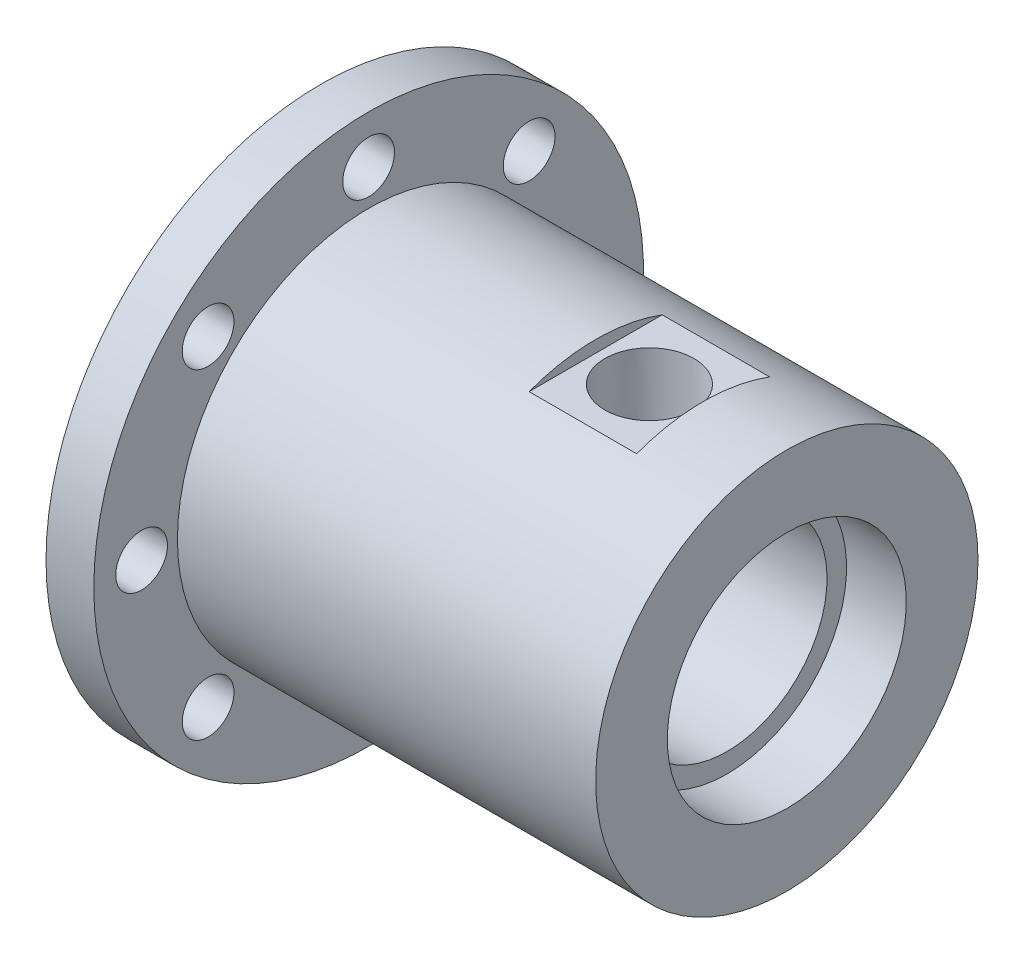
ISO-10303-21;
HEADER;
FILE_DESCRIPTION(('STEP AP214'),'2;1');
FILE_NAME('part.step','',(''),(''),'','','');
FILE_SCHEMA(('AUTOMOTIVE_DESIGN { 1 0 10303 214 1 1 1 1 }'));
ENDSEC;
DATA;
#1=APPLICATION_CONTEXT('core data for automotive mechanical design processes');
#2=APPLICATION_PROTOCOL_DEFINITION('international standard','automotive_design',2000,#1);
#3=PRODUCT_CONTEXT('',#1,'mechanical');
#4=PRODUCT('Part','Part','',(#3));
#5=PRODUCT_RELATED_PRODUCT_CATEGORY('part','',(#4));
#6=PRODUCT_DEFINITION_FORMATION('','',#4);
#7=PRODUCT_DEFINITION_CONTEXT('part definition',#1,'design');
#8=PRODUCT_DEFINITION('design','',#6,#7);
#9=PRODUCT_DEFINITION_SHAPE('','',#8);
#10=(LENGTH_UNIT() NAMED_UNIT(*) SI_UNIT(.MILLI.,.METRE.));
#11=(NAMED_UNIT(*) PLANE_ANGLE_UNIT() SI_UNIT($,.RADIAN.));
#12=(NAMED_UNIT(*) SI_UNIT($,.STERADIAN.) SOLID_ANGLE_UNIT());
#13=UNCERTAINTY_MEASURE_WITH_UNIT(LENGTH_MEASURE(1.E-05),#10,'distance_accuracy_value','');
#14=(GEOMETRIC_REPRESENTATION_CONTEXT(3) GLOBAL_UNCERTAINTY_ASSIGNED_CONTEXT((#13)) GLOBAL_UNIT_ASSIGNED_CONTEXT((#10,
#11,#12)) REPRESENTATION_CONTEXT('',''));
#15=CARTESIAN_POINT('',(0.,0.,0.));
#16=DIRECTION('',(0.,0.,1.));
#17=DIRECTION('',(1.,0.,0.));
#18=AXIS2_PLACEMENT_3D('',#15,#16,#17);
#19=CARTESIAN_POINT('',(-49.53,0.,0.));
#20=DIRECTION('',(1.,0.,0.));
#21=DIRECTION('',(0.,0.,-1.));
#22=AXIS2_PLACEMENT_3D('',#19,#20,#21);
#23=PLANE('',#22);
#24=CARTESIAN_POINT('',(-49.53,0.,0.));
#25=DIRECTION('',(1.,0.,0.));
#26=DIRECTION('',(0.,1.,0.));
#27=AXIS2_PLACEMENT_3D('',#24,#25,#26);
#28=CIRCLE('',#27,12.7);
#29=CARTESIAN_POINT('',(-49.53,12.7,0.));
#30=VERTEX_POINT('',#29);
#31=EDGE_CURVE('E171',#30,#30,#28,.T.);
#32=ORIENTED_EDGE('',*,*,#31,.T.);
#33=EDGE_LOOP('',(#32));
#34=FACE_BOUND('',#33,.T.);
#35=CARTESIAN_POINT('',(-49.53,0.,0.));
#36=DIRECTION('',(-1.,0.,0.));
#37=DIRECTION('',(0.,0.,1.));
#38=AXIS2_PLACEMENT_3D('',#35,#36,#37);
#39=CIRCLE('',#38,14.1478);
#40=CARTESIAN_POINT('',(-49.53,0.,14.1478));
#41=VERTEX_POINT('',#40);
#42=EDGE_CURVE('E512',#41,#41,#39,.T.);
#43=ORIENTED_EDGE('',*,*,#42,.T.);
#44=EDGE_LOOP('',(#43));
#45=FACE_BOUND('',#44,.T.);
#46=ADVANCED_FACE('F46',(#34,#45),#23,.F.);
#47=CARTESIAN_POINT('',(-44.45,0.,0.));
#48=DIRECTION('',(-1.,0.,0.));
#49=DIRECTION('',(0.,0.,1.));
#50=AXIS2_PLACEMENT_3D('',#47,#48,#49);
#51=PLANE('',#50);
#52=CARTESIAN_POINT('',(-44.45,24.13,0.));
#53=DIRECTION('',(1.,0.,0.));
#54=DIRECTION('',(0.,0.,-1.));
#55=AXIS2_PLACEMENT_3D('',#52,#53,#54);
#56=CIRCLE('',#55,2.74999999999999);
#57=CARTESIAN_POINT('',(-44.45,24.13,-2.74999999999999));
#58=VERTEX_POINT('',#57);
#59=EDGE_CURVE('E84',#58,#58,#56,.T.);
#60=ORIENTED_EDGE('',*,*,#59,.F.);
#61=EDGE_LOOP('',(#60));
#62=FACE_BOUND('',#61,.T.);
#63=CARTESIAN_POINT('',(-44.45,-24.13,-3.42021402459922E-12));
#64=DIRECTION('',(1.,0.,0.));
#65=DIRECTION('',(0.,0.,-1.));
#66=AXIS2_PLACEMENT_3D('',#63,#64,#65);
#67=CIRCLE('',#66,2.74999999999999);
#68=CARTESIAN_POINT('',(-44.45,-24.13,-2.75000000000341));
#69=VERTEX_POINT('',#68);
#70=EDGE_CURVE('E119',#69,#69,#67,.T.);
#71=ORIENTED_EDGE('',*,*,#70,.F.);
#72=EDGE_LOOP('',(#71));
#73=FACE_BOUND('',#72,.T.);
#74=CARTESIAN_POINT('',(-44.45,0.,0.));
#75=DIRECTION('',(-1.,0.,0.));
#76=DIRECTION('',(0.,0.,1.));
#77=AXIS2_PLACEMENT_3D('',#74,#75,#76);
#78=CIRCLE('',#77,20.32);
#79=CARTESIAN_POINT('',(-44.45,0.,20.32));
#80=VERTEX_POINT('',#79);
#81=EDGE_CURVE('E147',#80,#80,#78,.F.);
#82=ORIENTED_EDGE('',*,*,#81,.F.);
#83=EDGE_LOOP('',(#82));
#84=FACE_BOUND('',#83,.T.);
#85=CARTESIAN_POINT('',(-44.45,0.,0.));
#86=DIRECTION('',(-1.,0.,0.));
#87=DIRECTION('',(0.,0.,1.));
#88=AXIS2_PLACEMENT_3D('',#85,#86,#87);
#89=CIRCLE('',#88,29.21);
#90=CARTESIAN_POINT('',(-44.45,0.,29.21));
#91=VERTEX_POINT('',#90);
#92=EDGE_CURVE('E144',#91,#91,#89,.T.);
#93=ORIENTED_EDGE('',*,*,#92,.F.);
#94=EDGE_LOOP('',(#93));
#95=FACE_BOUND('',#94,.T.);
#96=CARTESIAN_POINT('',(-44.45,17.0624866300302,17.0624866300309));
#97=DIRECTION('',(1.,0.,0.));
#98=DIRECTION('',(0.,0.,-1.));
#99=AXIS2_PLACEMENT_3D('',#96,#97,#98);
#100=CIRCLE('',#99,2.74999999999999);
#101=CARTESIAN_POINT('',(-44.45,17.0624866300302,14.3124866300309));
#102=VERTEX_POINT('',#101);
#103=EDGE_CURVE('E137',#102,#102,#100,.T.);
#104=ORIENTED_EDGE('',*,*,#103,.F.);
#105=EDGE_LOOP('',(#104));
#106=FACE_BOUND('',#105,.T.);
#107=CARTESIAN_POINT('',(-44.45,-1.71306208502595E-12,24.1299999999983));
#108=DIRECTION('',(1.,0.,0.));
#109=DIRECTION('',(0.,0.,-1.));
#110=AXIS2_PLACEMENT_3D('',#107,#108,#109);
#111=CIRCLE('',#110,2.74999999999999);
#112=CARTESIAN_POINT('',(-44.45,-1.71306208502595E-12,21.3799999999983));
#113=VERTEX_POINT('',#112);
#114=EDGE_CURVE('E131',#113,#113,#111,.T.);
#115=ORIENTED_EDGE('',*,*,#114,.F.);
#116=EDGE_LOOP('',(#115));
#117=FACE_BOUND('',#116,.T.);
#118=CARTESIAN_POINT('',(-44.45,-17.0624866300326,17.0624866300285));
#119=DIRECTION('',(1.,0.,0.));
#120=DIRECTION('',(0.,0.,-1.));
#121=AXIS2_PLACEMENT_3D('',#118,#119,#120);
#122=CIRCLE('',#121,2.74999999999999);
#123=CARTESIAN_POINT('',(-44.45,-17.0624866300326,14.3124866300285));
#124=VERTEX_POINT('',#123);
#125=EDGE_CURVE('E125',#124,#124,#122,.T.);
#126=ORIENTED_EDGE('',*,*,#125,.F.);
#127=EDGE_LOOP('',(#126));
#128=FACE_BOUND('',#127,.T.);
#129=CARTESIAN_POINT('',(-44.45,-17.0624866300302,-17.0624866300343));
#130=DIRECTION('',(1.,0.,0.));
#131=DIRECTION('',(0.,0.,-1.));
#132=AXIS2_PLACEMENT_3D('',#129,#130,#131);
#133=CIRCLE('',#132,2.74999999999999);
#134=CARTESIAN_POINT('',(-44.45,-17.0624866300302,-19.8124866300343));
#135=VERTEX_POINT('',#134);
#136=EDGE_CURVE('E113',#135,#135,#133,.T.);
#137=ORIENTED_EDGE('',*,*,#136,.F.);
#138=EDGE_LOOP('',(#137));
#139=FACE_BOUND('',#138,.T.);
#140=CARTESIAN_POINT('',(-44.45,1.71010701229961E-12,-24.1300000000017));
#141=DIRECTION('',(1.,0.,0.));
#142=DIRECTION('',(0.,0.,-1.));
#143=AXIS2_PLACEMENT_3D('',#140,#141,#142);
#144=CIRCLE('',#143,2.74999999999999);
#145=CARTESIAN_POINT('',(-44.45,1.71010701229961E-12,-26.8800000000017));
#146=VERTEX_POINT('',#145);
#147=EDGE_CURVE('E107',#146,#146,#144,.T.);
#148=ORIENTED_EDGE('',*,*,#147,.F.);
#149=EDGE_LOOP('',(#148));
#150=FACE_BOUND('',#149,.T.);
#151=CARTESIAN_POINT('',(-44.45,17.0624866300326,-17.0624866300319));
#152=DIRECTION('',(1.,0.,0.));
#153=DIRECTION('',(0.,0.,-1.));
#154=AXIS2_PLACEMENT_3D('',#151,#152,#153);
#155=CIRCLE('',#154,2.74999999999999);
#156=CARTESIAN_POINT('',(-44.45,17.0624866300326,-19.8124866300319));
#157=VERTEX_POINT('',#156);
#158=EDGE_CURVE('E101',#157,#157,#155,.T.);
#159=ORIENTED_EDGE('',*,*,#158,.F.);
#160=EDGE_LOOP('',(#159));
#161=FACE_BOUND('',#160,.T.);
#162=ADVANCED_FACE('F212',(#62,#73,#84,#95,#106,#117,#128,#139,#150,#161),#51,.F.);
#163=CARTESIAN_POINT('',(-49.53,0.,0.));
#164=DIRECTION('',(1.,0.,0.));
#165=DIRECTION('',(0.,0.,-1.));
#166=AXIS2_PLACEMENT_3D('',#163,#164,#165);
#167=CYLINDRICAL_SURFACE('',#166,20.32);
#168=CARTESIAN_POINT('',(-20.32,0.,0.));
#169=DIRECTION('',(-1.,0.,0.));
#170=DIRECTION('',(0.,0.,1.));
#171=AXIS2_PLACEMENT_3D('',#168,#169,#170);
#172=CIRCLE('',#171,20.32);
#173=CARTESIAN_POINT('',(-20.32,19.05,-7.07106074079413));
#174=VERTEX_POINT('',#173);
#175=CARTESIAN_POINT('',(-20.32,19.05,7.07106074079412));
#176=VERTEX_POINT('',#175);
#177=EDGE_CURVE('E73',#174,#176,#172,.F.);
#178=ORIENTED_EDGE('',*,*,#177,.F.);
#179=DIRECTION('',(1.,0.,0.));
#180=VECTOR('',#179,1.);
#181=CARTESIAN_POINT('',(-49.53,19.05,-7.07106074079413));
#182=LINE('',#181,#180);
#183=CARTESIAN_POINT('',(-8.89,19.05,-7.07106074079414));
#184=VERTEX_POINT('',#183);
#185=EDGE_CURVE('E54',#174,#184,#182,.T.);
#186=ORIENTED_EDGE('',*,*,#185,.T.);
#187=CARTESIAN_POINT('',(-8.89,0.,0.));
#188=DIRECTION('',(1.,0.,0.));
#189=DIRECTION('',(0.,0.,-1.));
#190=AXIS2_PLACEMENT_3D('',#187,#188,#189);
#191=CIRCLE('',#190,20.32);
#192=CARTESIAN_POINT('',(-8.89,19.05,7.07106074079412));
#193=VERTEX_POINT('',#192);
#194=EDGE_CURVE('E67',#193,#184,#191,.F.);
#195=ORIENTED_EDGE('',*,*,#194,.F.);
#196=DIRECTION('',(1.,0.,0.));
#197=VECTOR('',#196,1.);
#198=CARTESIAN_POINT('',(-49.53,19.05,7.07106074079413));
#199=LINE('',#198,#197);
#200=EDGE_CURVE('E11',#193,#176,#199,.F.);
#201=ORIENTED_EDGE('',*,*,#200,.T.);
#202=EDGE_LOOP('',(#178,#186,#195,#201));
#203=FACE_BOUND('',#202,.T.);
#204=CARTESIAN_POINT('',(0.,0.,0.));
#205=DIRECTION('',(1.,0.,0.));
#206=DIRECTION('',(0.,0.,-1.));
#207=AXIS2_PLACEMENT_3D('',#204,#205,#206);
#208=CIRCLE('',#207,20.32);
#209=CARTESIAN_POINT('',(0.,0.,-20.32));
#210=VERTEX_POINT('',#209);
#211=EDGE_CURVE('E192',#210,#210,#208,.T.);
#212=ORIENTED_EDGE('',*,*,#211,.F.);
#213=EDGE_LOOP('',(#212));
#214=FACE_BOUND('',#213,.T.);
#215=ORIENTED_EDGE('',*,*,#81,.T.);
#216=EDGE_LOOP('',(#215));
#217=FACE_BOUND('',#216,.T.);
#218=ADVANCED_FACE('F48',(#203,#214,#217),#167,.T.);
#219=CARTESIAN_POINT('',(-49.53,0.,0.));
#220=DIRECTION('',(-1.,0.,0.));
#221=DIRECTION('',(0.,0.,1.));
#222=AXIS2_PLACEMENT_3D('',#219,#220,#221);
#223=CIRCLE('',#222,16.7132);
#224=CARTESIAN_POINT('',(-49.53,0.,16.7132));
#225=VERTEX_POINT('',#224);
#226=EDGE_CURVE('E237',#225,#225,#223,.T.);
#227=ORIENTED_EDGE('',*,*,#226,.F.);
#228=EDGE_LOOP('',(#227));
#229=FACE_BOUND('',#228,.T.);
#230=CARTESIAN_POINT('',(-49.53,24.13,0.));
#231=DIRECTION('',(1.,0.,0.));
#232=DIRECTION('',(0.,0.,-1.));
#233=AXIS2_PLACEMENT_3D('',#230,#231,#232);
#234=CIRCLE('',#233,2.74999999999999);
#235=CARTESIAN_POINT('',(-49.53,24.13,-2.74999999999999));
#236=VERTEX_POINT('',#235);
#237=EDGE_CURVE('E98',#236,#236,#234,.T.);
#238=ORIENTED_EDGE('',*,*,#237,.T.);
#239=EDGE_LOOP('',(#238));
#240=FACE_BOUND('',#239,.T.);
#241=CARTESIAN_POINT('',(-49.53,17.0624866300326,-17.0624866300319));
#242=DIRECTION('',(1.,0.,0.));
#243=DIRECTION('',(0.,0.,-1.));
#244=AXIS2_PLACEMENT_3D('',#241,#242,#243);
#245=CIRCLE('',#244,2.74999999999999);
#246=CARTESIAN_POINT('',(-49.53,17.0624866300326,-19.8124866300319));
#247=VERTEX_POINT('',#246);
#248=EDGE_CURVE('E104',#247,#247,#245,.T.);
#249=ORIENTED_EDGE('',*,*,#248,.T.);
#250=EDGE_LOOP('',(#249));
#251=FACE_BOUND('',#250,.T.);
#252=CARTESIAN_POINT('',(-49.53,1.71010701229961E-12,-24.1300000000017));
#253=DIRECTION('',(1.,0.,0.));
#254=DIRECTION('',(0.,0.,-1.));
#255=AXIS2_PLACEMENT_3D('',#252,#253,#254);
#256=CIRCLE('',#255,2.74999999999999);
#257=CARTESIAN_POINT('',(-49.53,1.71010701229961E-12,-26.8800000000017));
#258=VERTEX_POINT('',#257);
#259=EDGE_CURVE('E110',#258,#258,#256,.T.);
#260=ORIENTED_EDGE('',*,*,#259,.T.);
#261=EDGE_LOOP('',(#260));
#262=FACE_BOUND('',#261,.T.);
#263=CARTESIAN_POINT('',(-49.53,-17.0624866300302,-17.0624866300343));
#264=DIRECTION('',(1.,0.,0.));
#265=DIRECTION('',(0.,0.,-1.));
#266=AXIS2_PLACEMENT_3D('',#263,#264,#265);
#267=CIRCLE('',#266,2.74999999999999);
#268=CARTESIAN_POINT('',(-49.53,-17.0624866300302,-19.8124866300343));
#269=VERTEX_POINT('',#268);
#270=EDGE_CURVE('E116',#269,#269,#267,.T.);
#271=ORIENTED_EDGE('',*,*,#270,.T.);
#272=EDGE_LOOP('',(#271));
#273=FACE_BOUND('',#272,.T.);
#274=CARTESIAN_POINT('',(-49.53,-24.13,-3.42021402459922E-12));
#275=DIRECTION('',(1.,0.,0.));
#276=DIRECTION('',(0.,0.,-1.));
#277=AXIS2_PLACEMENT_3D('',#274,#275,#276);
#278=CIRCLE('',#277,2.74999999999999);
#279=CARTESIAN_POINT('',(-49.53,-24.13,-2.75000000000341));
#280=VERTEX_POINT('',#279);
#281=EDGE_CURVE('E122',#280,#280,#278,.T.);
#282=ORIENTED_EDGE('',*,*,#281,.T.);
#283=EDGE_LOOP('',(#282));
#284=FACE_BOUND('',#283,.T.);
#285=CARTESIAN_POINT('',(-49.53,-17.0624866300326,17.0624866300285));
#286=DIRECTION('',(1.,0.,0.));
#287=DIRECTION('',(0.,0.,-1.));
#288=AXIS2_PLACEMENT_3D('',#285,#286,#287);
#289=CIRCLE('',#288,2.74999999999999);
#290=CARTESIAN_POINT('',(-49.53,-17.0624866300326,14.3124866300285));
#291=VERTEX_POINT('',#290);
#292=EDGE_CURVE('E128',#291,#291,#289,.T.);
#293=ORIENTED_EDGE('',*,*,#292,.T.);
#294=EDGE_LOOP('',(#293));
#295=FACE_BOUND('',#294,.T.);
#296=CARTESIAN_POINT('',(-49.53,-1.71306208502595E-12,24.1299999999983));
#297=DIRECTION('',(1.,0.,0.));
#298=DIRECTION('',(0.,0.,-1.));
#299=AXIS2_PLACEMENT_3D('',#296,#297,#298);
#300=CIRCLE('',#299,2.74999999999999);
#301=CARTESIAN_POINT('',(-49.53,-1.71306208502595E-12,21.3799999999983));
#302=VERTEX_POINT('',#301);
#303=EDGE_CURVE('E134',#302,#302,#300,.T.);
#304=ORIENTED_EDGE('',*,*,#303,.T.);
#305=EDGE_LOOP('',(#304));
#306=FACE_BOUND('',#305,.T.);
#307=CARTESIAN_POINT('',(-49.53,17.0624866300302,17.0624866300309));
#308=DIRECTION('',(1.,0.,0.));
#309=DIRECTION('',(0.,0.,-1.));
#310=AXIS2_PLACEMENT_3D('',#307,#308,#309);
#311=CIRCLE('',#310,2.74999999999999);
#312=CARTESIAN_POINT('',(-49.53,17.0624866300302,14.3124866300309));
#313=VERTEX_POINT('',#312);
#314=EDGE_CURVE('E140',#313,#313,#311,.T.);
#315=ORIENTED_EDGE('',*,*,#314,.T.);
#316=EDGE_LOOP('',(#315));
#317=FACE_BOUND('',#316,.T.);
#318=CARTESIAN_POINT('',(-49.53,0.,0.));
#319=DIRECTION('',(-1.,0.,0.));
#320=DIRECTION('',(0.,0.,1.));
#321=AXIS2_PLACEMENT_3D('',#318,#319,#320);
#322=CIRCLE('',#321,29.21);
#323=CARTESIAN_POINT('',(-49.53,0.,29.21));
#324=VERTEX_POINT('',#323);
#325=EDGE_CURVE('E143',#324,#324,#322,.T.);
#326=ORIENTED_EDGE('',*,*,#325,.T.);
#327=EDGE_LOOP('',(#326));
#328=FACE_BOUND('',#327,.T.);
#329=ADVANCED_FACE('F215',(#229,#240,#251,#262,#273,#284,#295,#306,#317,#328),#23,.F.);
#330=CARTESIAN_POINT('',(0.,0.,0.));
#331=DIRECTION('',(1.,0.,0.));
#332=DIRECTION('',(0.,0.,-1.));
#333=AXIS2_PLACEMENT_3D('',#330,#331,#332);
#334=PLANE('',#333);
#335=CARTESIAN_POINT('',(0.,0.,0.));
#336=DIRECTION('',(1.,0.,0.));
#337=DIRECTION('',(0.,1.,0.));
#338=AXIS2_PLACEMENT_3D('',#335,#336,#337);
#339=CIRCLE('',#338,12.7);
#340=CARTESIAN_POINT('',(0.,12.7,0.));
#341=VERTEX_POINT('',#340);
#342=EDGE_CURVE('E168',#341,#341,#339,.T.);
#343=ORIENTED_EDGE('',*,*,#342,.F.);
#344=EDGE_LOOP('',(#343));
#345=FACE_BOUND('',#344,.T.);
#346=ORIENTED_EDGE('',*,*,#211,.T.);
#347=EDGE_LOOP('',(#346));
#348=FACE_BOUND('',#347,.T.);
#349=ADVANCED_FACE('F225',(#345,#348),#334,.T.);
#350=CARTESIAN_POINT('',(0.,0.,0.));
#351=DIRECTION('',(1.,0.,0.));
#352=DIRECTION('',(0.,1.,0.));
#353=AXIS2_PLACEMENT_3D('',#350,#351,#352);
#354=CYLINDRICAL_SURFACE('',#353,10.6299);
#355=CARTESIAN_POINT('',(-30.6578,0.,0.));
#356=DIRECTION('',(1.,0.,0.));
#357=DIRECTION('',(0.,1.,0.));
#358=AXIS2_PLACEMENT_3D('',#355,#356,#357);
#359=CIRCLE('',#358,10.6299);
#360=CARTESIAN_POINT('',(-30.6578,10.6299,0.));
#361=VERTEX_POINT('',#360);
#362=EDGE_CURVE('E189',#361,#361,#359,.T.);
#363=ORIENTED_EDGE('',*,*,#362,.F.);
#364=EDGE_LOOP('',(#363));
#365=FACE_BOUND('',#364,.T.);
#366=CARTESIAN_POINT('',(-28.8798,0.,0.));
#367=DIRECTION('',(1.,0.,0.));
#368=DIRECTION('',(0.,1.,0.));
#369=AXIS2_PLACEMENT_3D('',#366,#367,#368);
#370=CIRCLE('',#369,10.6299);
#371=CARTESIAN_POINT('',(-28.8798,10.6299,0.));
#372=VERTEX_POINT('',#371);
#373=EDGE_CURVE('E150',#372,#372,#370,.T.);
#374=ORIENTED_EDGE('',*,*,#373,.T.);
#375=EDGE_LOOP('',(#374));
#376=FACE_BOUND('',#375,.T.);
#377=ADVANCED_FACE('F231',(#365,#376),#354,.F.);
#378=CARTESIAN_POINT('',(-30.6578,10.6299,0.));
#379=DIRECTION('',(1.,0.,0.));
#380=DIRECTION('',(0.,1.,0.));
#381=AXIS2_PLACEMENT_3D('',#378,#379,#380);
#382=PLANE('',#381);
#383=CARTESIAN_POINT('',(-30.6578,0.,0.));
#384=DIRECTION('',(1.,0.,0.));
#385=DIRECTION('',(0.,1.,0.));
#386=AXIS2_PLACEMENT_3D('',#383,#384,#385);
#387=CIRCLE('',#386,11.9507);
#388=CARTESIAN_POINT('',(-30.6578,11.9507,0.));
#389=VERTEX_POINT('',#388);
#390=EDGE_CURVE('E186',#389,#389,#387,.T.);
#391=ORIENTED_EDGE('',*,*,#390,.F.);
#392=EDGE_LOOP('',(#391));
#393=FACE_BOUND('',#392,.T.);
#394=ORIENTED_EDGE('',*,*,#362,.T.);
#395=EDGE_LOOP('',(#394));
#396=FACE_BOUND('',#395,.T.);
#397=ADVANCED_FACE('F310',(#393,#396),#382,.F.);
#398=CARTESIAN_POINT('',(0.,0.,0.));
#399=DIRECTION('',(1.,0.,0.));
#400=DIRECTION('',(0.,1.,0.));
#401=AXIS2_PLACEMENT_3D('',#398,#399,#400);
#402=CYLINDRICAL_SURFACE('',#401,11.9507);
#403=CARTESIAN_POINT('',(-33.02,0.,0.));
#404=DIRECTION('',(1.,0.,0.));
#405=DIRECTION('',(0.,1.,0.));
#406=AXIS2_PLACEMENT_3D('',#403,#404,#405);
#407=CIRCLE('',#406,11.9507);
#408=CARTESIAN_POINT('',(-33.02,11.9507,0.));
#409=VERTEX_POINT('',#408);
#410=EDGE_CURVE('E183',#409,#409,#407,.T.);
#411=ORIENTED_EDGE('',*,*,#410,.F.);
#412=EDGE_LOOP('',(#411));
#413=FACE_BOUND('',#412,.T.);
#414=ORIENTED_EDGE('',*,*,#390,.T.);
#415=EDGE_LOOP('',(#414));
#416=FACE_BOUND('',#415,.T.);
#417=ADVANCED_FACE('F306',(#413,#416),#402,.F.);
#418=CARTESIAN_POINT('',(-33.02,11.9507,0.));
#419=DIRECTION('',(-1.,0.,0.));
#420=DIRECTION('',(0.,-1.,0.));
#421=AXIS2_PLACEMENT_3D('',#418,#419,#420);
#422=PLANE('',#421);
#423=CARTESIAN_POINT('',(-33.02,0.,0.));
#424=DIRECTION('',(1.,0.,0.));
#425=DIRECTION('',(0.,1.,0.));
#426=AXIS2_PLACEMENT_3D('',#423,#424,#425);
#427=CIRCLE('',#426,10.6299);
#428=CARTESIAN_POINT('',(-33.02,10.6299,0.));
#429=VERTEX_POINT('',#428);
#430=EDGE_CURVE('E180',#429,#429,#427,.T.);
#431=ORIENTED_EDGE('',*,*,#430,.F.);
#432=EDGE_LOOP('',(#431));
#433=FACE_BOUND('',#432,.T.);
#434=ORIENTED_EDGE('',*,*,#410,.T.);
#435=EDGE_LOOP('',(#434));
#436=FACE_BOUND('',#435,.T.);
#437=ADVANCED_FACE('F302',(#433,#436),#422,.F.);
#438=CARTESIAN_POINT('',(0.,0.,0.));
#439=DIRECTION('',(1.,0.,0.));
#440=DIRECTION('',(0.,1.,0.));
#441=AXIS2_PLACEMENT_3D('',#438,#439,#440);
#442=CYLINDRICAL_SURFACE('',#441,10.6299);
#443=CARTESIAN_POINT('',(-34.29,0.,0.));
#444=DIRECTION('',(1.,0.,0.));
#445=DIRECTION('',(0.,1.,0.));
#446=AXIS2_PLACEMENT_3D('',#443,#444,#445);
#447=CIRCLE('',#446,10.6299);
#448=CARTESIAN_POINT('',(-34.29,10.6299,0.));
#449=VERTEX_POINT('',#448);
#450=EDGE_CURVE('E177',#449,#449,#447,.T.);
#451=ORIENTED_EDGE('',*,*,#450,.F.);
#452=EDGE_LOOP('',(#451));
#453=FACE_BOUND('',#452,.T.);
#454=ORIENTED_EDGE('',*,*,#430,.T.);
#455=EDGE_LOOP('',(#454));
#456=FACE_BOUND('',#455,.T.);
#457=ADVANCED_FACE('F298',(#453,#456),#442,.F.);
#458=CARTESIAN_POINT('',(-34.29,12.7,0.));
#459=DIRECTION('',(1.,0.,0.));
#460=DIRECTION('',(0.,1.,0.));
#461=AXIS2_PLACEMENT_3D('',#458,#459,#460);
#462=PLANE('',#461);
#463=CARTESIAN_POINT('',(-34.29,0.,0.));
#464=DIRECTION('',(1.,0.,0.));
#465=DIRECTION('',(0.,1.,0.));
#466=AXIS2_PLACEMENT_3D('',#463,#464,#465);
#467=CIRCLE('',#466,12.7);
#468=CARTESIAN_POINT('',(-34.29,12.7,0.));
#469=VERTEX_POINT('',#468);
#470=EDGE_CURVE('E174',#469,#469,#467,.T.);
#471=ORIENTED_EDGE('',*,*,#470,.F.);
#472=EDGE_LOOP('',(#471));
#473=FACE_BOUND('',#472,.T.);
#474=ORIENTED_EDGE('',*,*,#450,.T.);
#475=EDGE_LOOP('',(#474));
#476=FACE_BOUND('',#475,.T.);
#477=ADVANCED_FACE('F294',(#473,#476),#462,.F.);
#478=CARTESIAN_POINT('',(0.,0.,0.));
#479=DIRECTION('',(1.,0.,0.));
#480=DIRECTION('',(0.,1.,0.));
#481=AXIS2_PLACEMENT_3D('',#478,#479,#480);
#482=CYLINDRICAL_SURFACE('',#481,12.7);
#483=ORIENTED_EDGE('',*,*,#31,.F.);
#484=EDGE_LOOP('',(#483));
#485=FACE_BOUND('',#484,.T.);
#486=ORIENTED_EDGE('',*,*,#470,.T.);
#487=EDGE_LOOP('',(#486));
#488=FACE_BOUND('',#487,.T.);
#489=ADVANCED_FACE('F290',(#485,#488),#482,.F.);
#490=CARTESIAN_POINT('',(0.,0.,0.));
#491=DIRECTION('',(1.,0.,0.));
#492=DIRECTION('',(0.,1.,0.));
#493=AXIS2_PLACEMENT_3D('',#490,#491,#492);
#494=CYLINDRICAL_SURFACE('',#493,12.7);
#495=CARTESIAN_POINT('',(-6.35,0.,0.));
#496=DIRECTION('',(1.,0.,0.));
#497=DIRECTION('',(0.,1.,0.));
#498=AXIS2_PLACEMENT_3D('',#495,#496,#497);
#499=CIRCLE('',#498,12.7);
#500=CARTESIAN_POINT('',(-6.35,12.7,0.));
#501=VERTEX_POINT('',#500);
#502=EDGE_CURVE('E165',#501,#501,#499,.T.);
#503=ORIENTED_EDGE('',*,*,#502,.F.);
#504=EDGE_LOOP('',(#503));
#505=FACE_BOUND('',#504,.T.);
#506=ORIENTED_EDGE('',*,*,#342,.T.);
#507=EDGE_LOOP('',(#506));
#508=FACE_BOUND('',#507,.T.);
#509=ADVANCED_FACE('F286',(#505,#508),#494,.F.);
#510=CARTESIAN_POINT('',(-6.35,10.6299,0.));
#511=DIRECTION('',(-1.,0.,0.));
#512=DIRECTION('',(0.,-1.,0.));
#513=AXIS2_PLACEMENT_3D('',#510,#511,#512);
#514=PLANE('',#513);
#515=CARTESIAN_POINT('',(-6.35,0.,0.));
#516=DIRECTION('',(1.,0.,0.));
#517=DIRECTION('',(0.,1.,0.));
#518=AXIS2_PLACEMENT_3D('',#515,#516,#517);
#519=CIRCLE('',#518,10.6299);
#520=CARTESIAN_POINT('',(-6.35,10.6299,0.));
#521=VERTEX_POINT('',#520);
#522=EDGE_CURVE('E162',#521,#521,#519,.T.);
#523=ORIENTED_EDGE('',*,*,#522,.F.);
#524=EDGE_LOOP('',(#523));
#525=FACE_BOUND('',#524,.T.);
#526=ORIENTED_EDGE('',*,*,#502,.T.);
#527=EDGE_LOOP('',(#526));
#528=FACE_BOUND('',#527,.T.);
#529=ADVANCED_FACE('F282',(#525,#528),#514,.F.);
#530=CARTESIAN_POINT('',(0.,0.,0.));
#531=DIRECTION('',(1.,0.,0.));
#532=DIRECTION('',(0.,1.,0.));
#533=AXIS2_PLACEMENT_3D('',#530,#531,#532);
#534=CYLINDRICAL_SURFACE('',#533,10.6299);
#535=CARTESIAN_POINT('',(-18.8214,10.6299,0.));
#536=CARTESIAN_POINT('',(-18.8213991945543,10.6298993726379,0.113457046151787));
#537=CARTESIAN_POINT('',(-18.816814338523,10.6280784642521,0.226950111245129));
#538=CARTESIAN_POINT('',(-18.7985176847204,10.6208411935619,0.453130349741782));
#539=CARTESIAN_POINT('',(-18.7848002812394,10.6154226229582,0.565816985178856));
#540=CARTESIAN_POINT('',(-18.7483354414901,10.6011173510872,0.789737366636714));
#541=CARTESIAN_POINT('',(-18.7255700848645,10.5922237678108,0.900967774116119));
#542=CARTESIAN_POINT('',(-18.6712434589909,10.5712092290137,1.12096196172459));
#543=CARTESIAN_POINT('',(-18.6396786220243,10.5590869645243,1.22972472197183));
#544=CARTESIAN_POINT('',(-18.5324475492501,10.5184193083287,1.55040561298491));
#545=CARTESIAN_POINT('',(-18.4440847481709,10.4855072239374,1.75768395016));
#546=CARTESIAN_POINT('',(-18.2364761213871,10.4112930066441,2.15420000503772));
#547=CARTESIAN_POINT('',(-18.1172394521627,10.3699933620817,2.34344304886747));
#548=CARTESIAN_POINT('',(-17.8454159459533,10.2810430780607,2.70768054108531));
#549=CARTESIAN_POINT('',(-17.6916311741971,10.2331976183667,2.88173291942367));
#550=CARTESIAN_POINT('',(-17.3574762651867,10.1374223027284,3.2024219207862));
#551=CARTESIAN_POINT('',(-17.1770937870015,10.0894924178671,3.34904574534681));
#552=CARTESIAN_POINT('',(-16.885632805964,10.0204076825348,3.54844469175999));
#553=CARTESIAN_POINT('',(-16.782600288112,9.9973979672625,3.61259680029724));
#554=CARTESIAN_POINT('',(-16.5710619093211,9.95346458541278,3.73193718417262));
#555=CARTESIAN_POINT('',(-16.4625582851231,9.93254007659276,3.78712908437146));
#556=CARTESIAN_POINT('',(-16.2407609991359,9.89345951632273,3.88808011276853));
#557=CARTESIAN_POINT('',(-16.1274669905629,9.87530366574026,3.93383855664947));
#558=CARTESIAN_POINT('',(-15.8969400622288,9.84240074560301,4.01545253055985));
#559=CARTESIAN_POINT('',(-15.7797091383352,9.82765197779623,4.05131299595643));
#560=CARTESIAN_POINT('',(-15.5474326323239,9.80266238743486,4.11139832218518));
#561=CARTESIAN_POINT('',(-15.4325206446889,9.7922506743705,4.13606861550772));
#562=CARTESIAN_POINT('',(-15.2008008980171,9.77539671649155,4.17574656713716));
#563=CARTESIAN_POINT('',(-15.0839940155927,9.76895268703824,4.19075856981811));
#564=CARTESIAN_POINT('',(-14.8494007739516,9.76026338070097,4.21095648243121));
#565=CARTESIAN_POINT('',(-14.7316146185022,9.75801725124586,4.21614438758813));
#566=CARTESIAN_POINT('',(-14.4960223494666,9.75780431142528,4.2166371687736));
#567=CARTESIAN_POINT('',(-14.3782162370327,9.75983730629026,4.21194249461973));
#568=CARTESIAN_POINT('',(-14.1516001818256,9.76782422661097,4.19338508170453));
#569=CARTESIAN_POINT('',(-14.0427268852946,9.7734999654463,4.18017253243749));
#570=CARTESIAN_POINT('',(-13.8265570088246,9.78831231918584,4.14536625948506));
#571=CARTESIAN_POINT('',(-13.7192609606703,9.79745007474718,4.12376977342197));
#572=CARTESIAN_POINT('',(-13.4008887225873,9.82966164770421,4.04669198256157));
#573=CARTESIAN_POINT('',(-13.1931354286744,9.85754131472573,3.97890617061676));
#574=CARTESIAN_POINT('',(-12.7879265076134,9.92358600589524,3.81122206124831));
#575=CARTESIAN_POINT('',(-12.5907640568164,9.96194761018688,3.71070213533045));
#576=CARTESIAN_POINT('',(-12.2153589740941,10.0445791383227,3.48081950381524));
#577=CARTESIAN_POINT('',(-12.0371234095995,10.0888512553619,3.35144607963582));
#578=CARTESIAN_POINT('',(-11.6904352601876,10.1824088790553,3.0559894186963));
#579=CARTESIAN_POINT('',(-11.5237520737886,10.2318198545954,2.88786516156883));
#580=CARTESIAN_POINT('',(-11.22038296138,10.3272265710403,2.52551696954652));
#581=CARTESIAN_POINT('',(-11.0837028127464,10.3732216530552,2.33128801952871));
#582=CARTESIAN_POINT('',(-10.8419536516729,10.4577321206331,1.91729696896603));
#583=CARTESIAN_POINT('',(-10.7375395820367,10.4960875365423,1.69711739907309));
#584=CARTESIAN_POINT('',(-10.5678391692907,10.5597909146131,1.2404119756265));
#585=CARTESIAN_POINT('',(-10.5025332926577,10.5851453695048,1.00389434846109));
#586=CARTESIAN_POINT('',(-10.4164561380339,10.6188125042287,0.536061001246169));
#587=CARTESIAN_POINT('',(-10.3933072115419,10.6280337820358,0.305247878602613));
#588=CARTESIAN_POINT('',(-10.3851937622588,10.6312502142889,-0.157126212906542));
#589=CARTESIAN_POINT('',(-10.4002195448976,10.6252492344689,-0.388686976990946));
#590=CARTESIAN_POINT('',(-10.4662720845973,10.5992909701863,-0.835275180490466));
#591=CARTESIAN_POINT('',(-10.5156848445691,10.579959716442,-1.05058169541187));
#592=CARTESIAN_POINT('',(-10.6469231081379,10.5299313058062,-1.46965580974149));
#593=CARTESIAN_POINT('',(-10.7287527850559,10.4992326855246,-1.67342191958774));
#594=CARTESIAN_POINT('',(-10.9251641011608,10.4282938172802,-2.07060920775167));
#595=CARTESIAN_POINT('',(-11.0406674005582,10.3877914254882,-2.26352625734826));
#596=CARTESIAN_POINT('',(-11.3001335689422,10.3016473185682,-2.62791734767858));
#597=CARTESIAN_POINT('',(-11.4441077372741,10.2560035660737,-2.7993828305911));
#598=CARTESIAN_POINT('',(-11.7673545646019,10.1608850160608,-3.12766317451026));
#599=CARTESIAN_POINT('',(-11.948312280123,10.1113539120127,-3.28280365067504));
#600=CARTESIAN_POINT('',(-12.3347242236542,10.0167843415747,-3.56096333241853));
#601=CARTESIAN_POINT('',(-12.5401821980635,9.97174656420998,-3.6839776162983));
#602=CARTESIAN_POINT('',(-12.8637008957961,9.91147985388475,-3.84194567273392));
#603=CARTESIAN_POINT('',(-12.9746856936485,9.89253031601207,-3.89034921162166));
#604=CARTESIAN_POINT('',(-13.2008257362157,9.85778869561991,-3.97755997557625));
#605=CARTESIAN_POINT('',(-13.3159791495704,9.84199524597961,-4.01637135740438));
#606=CARTESIAN_POINT('',(-13.5495779171878,9.81413338781144,-4.0839806825072));
#607=CARTESIAN_POINT('',(-13.6680220032022,9.80206356529851,-4.11278242730087));
#608=CARTESIAN_POINT('',(-13.9072991791149,9.78209214891221,-4.16006115903007));
#609=CARTESIAN_POINT('',(-14.0281320728995,9.77419021433039,-4.17853898991229));
#610=CARTESIAN_POINT('',(-14.2624992636406,9.76326471160909,-4.20399955166574));
#611=CARTESIAN_POINT('',(-14.3759410770823,9.75993401812867,-4.21170669305334));
#612=CARTESIAN_POINT('',(-14.6031632363253,9.75724541489494,-4.21793167544893));
#613=CARTESIAN_POINT('',(-14.7169436830192,9.75788883966012,-4.21644642963077));
#614=CARTESIAN_POINT('',(-14.9438698915691,9.76313093563568,-4.20429480673468));
#615=CARTESIAN_POINT('',(-15.057015940327,9.76772764420299,-4.19363298544763));
#616=CARTESIAN_POINT('',(-15.2818803847315,9.78070930330112,-4.16326290620638));
#617=CARTESIAN_POINT('',(-15.3935982259667,9.78909568160786,-4.14355123863518));
#618=CARTESIAN_POINT('',(-15.7168017101128,9.81876966423655,-4.07298008637714));
#619=CARTESIAN_POINT('',(-15.9253732661959,9.84482474850719,-4.01015548915978));
#620=CARTESIAN_POINT('',(-16.3289799582796,9.90701229693,-3.85394200172633));
#621=CARTESIAN_POINT('',(-16.5240114933146,9.94314742914408,-3.76054501824738));
#622=CARTESIAN_POINT('',(-16.9071894616751,10.0239608093252,-3.53970997495808));
#623=CARTESIAN_POINT('',(-17.0943209695979,10.0690069031976,-3.41064404192125));
#624=CARTESIAN_POINT('',(-17.4451819111267,10.161430094171,-3.1245311599853));
#625=CARTESIAN_POINT('',(-17.608902919326,10.2088080222912,-2.96747418260159));
#626=CARTESIAN_POINT('',(-17.9189437152039,10.3041654570311,-2.61796500901831));
#627=CARTESIAN_POINT('',(-18.0635003452639,10.3519924054655,-2.42389931249824));
#628=CARTESIAN_POINT('',(-18.3179736295552,10.4397612281899,-2.0125493652234));
#629=CARTESIAN_POINT('',(-18.4278859726663,10.4797021209116,-1.79526222930405));
#630=CARTESIAN_POINT('',(-18.6013438104178,10.5442672315282,-1.36261918322253));
#631=CARTESIAN_POINT('',(-18.668060746819,10.5699122976432,-1.14870012404828));
#632=CARTESIAN_POINT('',(-18.7420985951095,10.5986725179927,-0.821566023504805));
#633=CARTESIAN_POINT('',(-18.7624325632634,10.6066389285439,-0.711566732238598));
#634=CARTESIAN_POINT('',(-18.7943059857047,10.6191714121898,-0.490128515039046));
#635=CARTESIAN_POINT('',(-18.8058505933514,10.6237394777592,-0.378690471713396));
#636=CARTESIAN_POINT('',(-18.8157591157663,10.6276636104744,-0.222536124358105));
#637=CARTESIAN_POINT('',(-18.8178737411349,10.6285017135116,-0.178062681940566));
#638=CARTESIAN_POINT('',(-18.8206943812884,10.6296200472254,-0.0890613447564754));
#639=CARTESIAN_POINT('',(-18.8214003161485,10.6299002462482,-0.044533447043714));
#640=CARTESIAN_POINT('',(-18.8214,10.6299,0.));
#641=B_SPLINE_CURVE_WITH_KNOTS('',3,(#535,#536,#537,#538,#539,#540,#541,#542,#543,#544,#545,
#546,#547,#548,#549,#550,#551,#552,#553,#554,#555,#556,#557,#558,#559,#560,#561,#562,#563,#564,
#565,#566,#567,#568,#569,#570,#571,#572,#573,#574,#575,#576,#577,#578,#579,#580,#581,#582,#583,
#584,#585,#586,#587,#588,#589,#590,#591,#592,#593,#594,#595,#596,#597,#598,#599,#600,#601,#602,
#603,#604,#605,#606,#607,#608,#609,#610,#611,#612,#613,#614,#615,#616,#617,#618,#619,#620,#621,
#622,#623,#624,#625,#626,#627,#628,#629,#630,#631,#632,#633,#634,#635,#636,#637,#638,#639,#640),
.UNSPECIFIED.,.T.,.F.,(4,2,2,2,2,2,2,2,2,2,2,2,2,2,2,2,2,2,2,2,2,2,2,2,2,2,2,2,2,2,2,2,2,2,2,2,
2,2,2,2,2,2,2,2,2,2,2,2,2,2,2,2,4),(0.,0.340326121885028,0.680861334446199,1.0220743985333,
1.36342600798211,2.04321770263277,2.72280801714387,3.43116170420047,4.13984509686646,
4.51006128143359,4.88012731945507,5.25022019319205,5.62012819508509,5.97363391901857,
6.32698052195944,6.68025535428366,7.03351410722302,7.36256928938372,7.69173298228958,
8.34948606621022,9.02053954808584,9.69184273133132,10.4140994506347,11.1364951257097,
11.8727142051437,12.6085652549636,13.3014514248511,13.9941616520195,14.6563765881571,
15.3186768048892,16.0011496835589,16.6838939634841,17.4109732270898,18.1381638132204,
18.5054249963772,18.8725267467362,19.2394889242781,19.6064210994538,19.9472429507939,
20.2881792571552,20.6289464002828,20.9698420362144,21.6248201291467,22.2799717513085,
22.9722147585332,23.6647062793603,24.4011350332995,25.1376553919725,25.8109206627317,
26.1470307818666,26.4829436815356,26.616518774635,26.7501014461447),.UNSPECIFIED.);
#642=CARTESIAN_POINT('',(-18.8214,10.6299,0.));
#643=VERTEX_POINT('',#642);
#644=EDGE_CURVE('E82',#643,#643,#641,.T.);
#645=ORIENTED_EDGE('',*,*,#644,.T.);
#646=EDGE_LOOP('',(#645));
#647=FACE_BOUND('',#646,.T.);
#648=CARTESIAN_POINT('',(-26.5176,0.,0.));
#649=DIRECTION('',(1.,0.,0.));
#650=DIRECTION('',(0.,1.,0.));
#651=AXIS2_PLACEMENT_3D('',#648,#649,#650);
#652=CIRCLE('',#651,10.6299);
#653=CARTESIAN_POINT('',(-26.5176,10.6299,0.));
#654=VERTEX_POINT('',#653);
#655=EDGE_CURVE('E159',#654,#654,#652,.T.);
#656=ORIENTED_EDGE('',*,*,#655,.F.);
#657=EDGE_LOOP('',(#656));
#658=FACE_BOUND('',#657,.T.);
#659=ORIENTED_EDGE('',*,*,#522,.T.);
#660=EDGE_LOOP('',(#659));
#661=FACE_BOUND('',#660,.T.);
#662=ADVANCED_FACE('F279',(#647,#658,#661),#534,.F.);
#663=CARTESIAN_POINT('',(-26.5176,11.9507,0.));
#664=DIRECTION('',(1.,0.,0.));
#665=DIRECTION('',(0.,1.,0.));
#666=AXIS2_PLACEMENT_3D('',#663,#664,#665);
#667=PLANE('',#666);
#668=CARTESIAN_POINT('',(-26.5176,0.,0.));
#669=DIRECTION('',(1.,0.,0.));
#670=DIRECTION('',(0.,1.,0.));
#671=AXIS2_PLACEMENT_3D('',#668,#669,#670);
#672=CIRCLE('',#671,11.9507);
#673=CARTESIAN_POINT('',(-26.5176,11.9507,0.));
#674=VERTEX_POINT('',#673);
#675=EDGE_CURVE('E156',#674,#674,#672,.T.);
#676=ORIENTED_EDGE('',*,*,#675,.F.);
#677=EDGE_LOOP('',(#676));
#678=FACE_BOUND('',#677,.T.);
#679=ORIENTED_EDGE('',*,*,#655,.T.);
#680=EDGE_LOOP('',(#679));
#681=FACE_BOUND('',#680,.T.);
#682=ADVANCED_FACE('F275',(#678,#681),#667,.F.);
#683=CARTESIAN_POINT('',(0.,0.,0.));
#684=DIRECTION('',(1.,0.,0.));
#685=DIRECTION('',(0.,1.,0.));
#686=AXIS2_PLACEMENT_3D('',#683,#684,#685);
#687=CYLINDRICAL_SURFACE('',#686,11.9507);
#688=CARTESIAN_POINT('',(-28.8798,0.,0.));
#689=DIRECTION('',(1.,0.,0.));
#690=DIRECTION('',(0.,1.,0.));
#691=AXIS2_PLACEMENT_3D('',#688,#689,#690);
#692=CIRCLE('',#691,11.9507);
#693=CARTESIAN_POINT('',(-28.8798,11.9507,0.));
#694=VERTEX_POINT('',#693);
#695=EDGE_CURVE('E153',#694,#694,#692,.T.);
#696=ORIENTED_EDGE('',*,*,#695,.F.);
#697=EDGE_LOOP('',(#696));
#698=FACE_BOUND('',#697,.T.);
#699=ORIENTED_EDGE('',*,*,#675,.T.);
#700=EDGE_LOOP('',(#699));
#701=FACE_BOUND('',#700,.T.);
#702=ADVANCED_FACE('F269',(#698,#701),#687,.F.);
#703=CARTESIAN_POINT('',(-28.8798,10.6299,0.));
#704=DIRECTION('',(-1.,0.,0.));
#705=DIRECTION('',(0.,-1.,0.));
#706=AXIS2_PLACEMENT_3D('',#703,#704,#705);
#707=PLANE('',#706);
#708=ORIENTED_EDGE('',*,*,#373,.F.);
#709=EDGE_LOOP('',(#708));
#710=FACE_BOUND('',#709,.T.);
#711=ORIENTED_EDGE('',*,*,#695,.T.);
#712=EDGE_LOOP('',(#711));
#713=FACE_BOUND('',#712,.T.);
#714=ADVANCED_FACE('F259',(#710,#713),#707,.F.);
#715=CARTESIAN_POINT('',(-44.45,0.,0.));
#716=DIRECTION('',(-1.,0.,0.));
#717=DIRECTION('',(0.,0.,1.));
#718=AXIS2_PLACEMENT_3D('',#715,#716,#717);
#719=CYLINDRICAL_SURFACE('',#718,29.21);
#720=ORIENTED_EDGE('',*,*,#92,.T.);
#721=EDGE_LOOP('',(#720));
#722=FACE_BOUND('',#721,.T.);
#723=ORIENTED_EDGE('',*,*,#325,.F.);
#724=EDGE_LOOP('',(#723));
#725=FACE_BOUND('',#724,.T.);
#726=ADVANCED_FACE('F256',(#722,#725),#719,.T.);
#727=CARTESIAN_POINT('',(-44.45,17.0624866300302,17.0624866300309));
#728=DIRECTION('',(1.,0.,0.));
#729=DIRECTION('',(0.,0.,-1.));
#730=AXIS2_PLACEMENT_3D('',#727,#728,#729);
#731=CYLINDRICAL_SURFACE('',#730,2.74999999999999);
#732=ORIENTED_EDGE('',*,*,#314,.F.);
#733=EDGE_LOOP('',(#732));
#734=FACE_BOUND('',#733,.T.);
#735=ORIENTED_EDGE('',*,*,#103,.T.);
#736=EDGE_LOOP('',(#735));
#737=FACE_BOUND('',#736,.T.);
#738=ADVANCED_FACE('F258',(#734,#737),#731,.F.);
#739=CARTESIAN_POINT('',(-44.45,-1.71306208502595E-12,24.1299999999983));
#740=DIRECTION('',(1.,0.,0.));
#741=DIRECTION('',(0.,0.,-1.));
#742=AXIS2_PLACEMENT_3D('',#739,#740,#741);
#743=CYLINDRICAL_SURFACE('',#742,2.74999999999999);
#744=ORIENTED_EDGE('',*,*,#303,.F.);
#745=EDGE_LOOP('',(#744));
#746=FACE_BOUND('',#745,.T.);
#747=ORIENTED_EDGE('',*,*,#114,.T.);
#748=EDGE_LOOP('',(#747));
#749=FACE_BOUND('',#748,.T.);
#750=ADVANCED_FACE('F266',(#746,#749),#743,.F.);
#751=CARTESIAN_POINT('',(-44.45,-17.0624866300326,17.0624866300285));
#752=DIRECTION('',(1.,0.,0.));
#753=DIRECTION('',(0.,0.,-1.));
#754=AXIS2_PLACEMENT_3D('',#751,#752,#753);
#755=CYLINDRICAL_SURFACE('',#754,2.74999999999999);
#756=ORIENTED_EDGE('',*,*,#292,.F.);
#757=EDGE_LOOP('',(#756));
#758=FACE_BOUND('',#757,.T.);
#759=ORIENTED_EDGE('',*,*,#125,.T.);
#760=EDGE_LOOP('',(#759));
#761=FACE_BOUND('',#760,.T.);
#762=ADVANCED_FACE('F375',(#758,#761),#755,.F.);
#763=CARTESIAN_POINT('',(-44.45,-24.13,-3.42021402459922E-12));
#764=DIRECTION('',(1.,0.,0.));
#765=DIRECTION('',(0.,0.,-1.));
#766=AXIS2_PLACEMENT_3D('',#763,#764,#765);
#767=CYLINDRICAL_SURFACE('',#766,2.74999999999999);
#768=ORIENTED_EDGE('',*,*,#281,.F.);
#769=EDGE_LOOP('',(#768));
#770=FACE_BOUND('',#769,.T.);
#771=ORIENTED_EDGE('',*,*,#70,.T.);
#772=EDGE_LOOP('',(#771));
#773=FACE_BOUND('',#772,.T.);
#774=ADVANCED_FACE('F371',(#770,#773),#767,.F.);
#775=CARTESIAN_POINT('',(-44.45,-17.0624866300302,-17.0624866300343));
#776=DIRECTION('',(1.,0.,0.));
#777=DIRECTION('',(0.,0.,-1.));
#778=AXIS2_PLACEMENT_3D('',#775,#776,#777);
#779=CYLINDRICAL_SURFACE('',#778,2.74999999999999);
#780=ORIENTED_EDGE('',*,*,#270,.F.);
#781=EDGE_LOOP('',(#780));
#782=FACE_BOUND('',#781,.T.);
#783=ORIENTED_EDGE('',*,*,#136,.T.);
#784=EDGE_LOOP('',(#783));
#785=FACE_BOUND('',#784,.T.);
#786=ADVANCED_FACE('F365',(#782,#785),#779,.F.);
#787=CARTESIAN_POINT('',(-44.45,1.71010701229961E-12,-24.1300000000017));
#788=DIRECTION('',(1.,0.,0.));
#789=DIRECTION('',(0.,0.,-1.));
#790=AXIS2_PLACEMENT_3D('',#787,#788,#789);
#791=CYLINDRICAL_SURFACE('',#790,2.74999999999999);
#792=ORIENTED_EDGE('',*,*,#259,.F.);
#793=EDGE_LOOP('',(#792));
#794=FACE_BOUND('',#793,.T.);
#795=ORIENTED_EDGE('',*,*,#147,.T.);
#796=EDGE_LOOP('',(#795));
#797=FACE_BOUND('',#796,.T.);
#798=ADVANCED_FACE('F356',(#794,#797),#791,.F.);
#799=CARTESIAN_POINT('',(-44.45,17.0624866300326,-17.0624866300319));
#800=DIRECTION('',(1.,0.,0.));
#801=DIRECTION('',(0.,0.,-1.));
#802=AXIS2_PLACEMENT_3D('',#799,#800,#801);
#803=CYLINDRICAL_SURFACE('',#802,2.74999999999999);
#804=ORIENTED_EDGE('',*,*,#248,.F.);
#805=EDGE_LOOP('',(#804));
#806=FACE_BOUND('',#805,.T.);
#807=ORIENTED_EDGE('',*,*,#158,.T.);
#808=EDGE_LOOP('',(#807));
#809=FACE_BOUND('',#808,.T.);
#810=ADVANCED_FACE('F354',(#806,#809),#803,.F.);
#811=CARTESIAN_POINT('',(-44.45,24.13,0.));
#812=DIRECTION('',(1.,0.,0.));
#813=DIRECTION('',(0.,0.,-1.));
#814=AXIS2_PLACEMENT_3D('',#811,#812,#813);
#815=CYLINDRICAL_SURFACE('',#814,2.74999999999999);
#816=ORIENTED_EDGE('',*,*,#237,.F.);
#817=EDGE_LOOP('',(#816));
#818=FACE_BOUND('',#817,.T.);
#819=ORIENTED_EDGE('',*,*,#59,.T.);
#820=EDGE_LOOP('',(#819));
#821=FACE_BOUND('',#820,.T.);
#822=ADVANCED_FACE('F209',(#818,#821),#815,.F.);
#823=CARTESIAN_POINT('',(-20.32,19.05,-12.7));
#824=DIRECTION('',(-1.,0.,0.));
#825=DIRECTION('',(0.,0.,1.));
#826=AXIS2_PLACEMENT_3D('',#823,#824,#825);
#827=PLANE('',#826);
#828=DIRECTION('',(0.,0.,1.));
#829=VECTOR('',#828,1.);
#830=CARTESIAN_POINT('',(-20.32,19.05,-12.7));
#831=LINE('',#830,#829);
#832=EDGE_CURVE('E80',#174,#176,#831,.T.);
#833=ORIENTED_EDGE('',*,*,#832,.F.);
#834=ORIENTED_EDGE('',*,*,#177,.T.);
#835=EDGE_LOOP('',(#833,#834));
#836=FACE_BOUND('',#835,.T.);
#837=ADVANCED_FACE('F81',(#836),#827,.F.);
#838=CARTESIAN_POINT('',(-8.89,19.05,-12.7));
#839=DIRECTION('',(1.,0.,0.));
#840=DIRECTION('',(0.,0.,-1.));
#841=AXIS2_PLACEMENT_3D('',#838,#839,#840);
#842=PLANE('',#841);
#843=DIRECTION('',(0.,0.,-1.));
#844=VECTOR('',#843,1.);
#845=CARTESIAN_POINT('',(-8.89,19.05,-12.7));
#846=LINE('',#845,#844);
#847=EDGE_CURVE('E61',#193,#184,#846,.T.);
#848=ORIENTED_EDGE('',*,*,#847,.F.);
#849=ORIENTED_EDGE('',*,*,#194,.T.);
#850=EDGE_LOOP('',(#848,#849));
#851=FACE_BOUND('',#850,.T.);
#852=ADVANCED_FACE('F198',(#851),#842,.F.);
#853=CARTESIAN_POINT('',(0.,19.05,0.));
#854=DIRECTION('',(0.,1.,0.));
#855=DIRECTION('',(0.,0.,1.));
#856=AXIS2_PLACEMENT_3D('',#853,#854,#855);
#857=PLANE('',#856);
#858=CARTESIAN_POINT('',(-14.605,19.05,0.));
#859=DIRECTION('',(0.,1.,0.));
#860=DIRECTION('',(0.,0.,1.));
#861=AXIS2_PLACEMENT_3D('',#858,#859,#860);
#862=CIRCLE('',#861,4.7427388);
#863=CARTESIAN_POINT('',(-14.605,19.05,4.7427388));
#864=VERTEX_POINT('',#863);
#865=EDGE_CURVE('E519',#864,#864,#862,.T.);
#866=ORIENTED_EDGE('',*,*,#865,.F.);
#867=EDGE_LOOP('',(#866));
#868=FACE_BOUND('',#867,.T.);
#869=ORIENTED_EDGE('',*,*,#847,.T.);
#870=ORIENTED_EDGE('',*,*,#185,.F.);
#871=ORIENTED_EDGE('',*,*,#832,.T.);
#872=ORIENTED_EDGE('',*,*,#200,.F.);
#873=EDGE_LOOP('',(#869,#870,#871,#872));
#874=FACE_BOUND('',#873,.T.);
#875=ADVANCED_FACE('F79',(#868,#874),#857,.T.);
#876=CARTESIAN_POINT('',(-14.605,19.05,0.));
#877=DIRECTION('',(0.,1.,0.));
#878=DIRECTION('',(0.,0.,1.));
#879=AXIS2_PLACEMENT_3D('',#876,#877,#878);
#880=CYLINDRICAL_SURFACE('',#879,4.2164);
#881=ORIENTED_EDGE('',*,*,#644,.F.);
#882=EDGE_LOOP('',(#881));
#883=FACE_BOUND('',#882,.T.);
#884=CARTESIAN_POINT('',(-14.605,12.192,0.));
#885=DIRECTION('',(0.,1.,0.));
#886=DIRECTION('',(0.,0.,1.));
#887=AXIS2_PLACEMENT_3D('',#884,#885,#886);
#888=CIRCLE('',#887,4.2164);
#889=CARTESIAN_POINT('',(-14.605,12.192,4.2164));
#890=VERTEX_POINT('',#889);
#891=EDGE_CURVE('E87',#890,#890,#888,.T.);
#892=ORIENTED_EDGE('',*,*,#891,.T.);
#893=EDGE_LOOP('',(#892));
#894=FACE_BOUND('',#893,.T.);
#895=ADVANCED_FACE('F206',(#883,#894),#880,.F.);
#896=CARTESIAN_POINT('',(-10.3886,12.192,0.));
#897=DIRECTION('',(0.,-1.,0.));
#898=DIRECTION('',(0.,0.,-1.));
#899=AXIS2_PLACEMENT_3D('',#896,#897,#898);
#900=PLANE('',#899);
#901=ORIENTED_EDGE('',*,*,#891,.F.);
#902=EDGE_LOOP('',(#901));
#903=FACE_BOUND('',#902,.T.);
#904=CARTESIAN_POINT('',(-14.605,12.192,0.));
#905=DIRECTION('',(0.,1.,0.));
#906=DIRECTION('',(0.,0.,1.));
#907=AXIS2_PLACEMENT_3D('',#904,#905,#906);
#908=CIRCLE('',#907,4.5374010959685);
#909=CARTESIAN_POINT('',(-14.605,12.192,4.5374010959685));
#910=VERTEX_POINT('',#909);
#911=EDGE_CURVE('E523',#910,#910,#908,.T.);
#912=ORIENTED_EDGE('',*,*,#911,.T.);
#913=EDGE_LOOP('',(#912));
#914=FACE_BOUND('',#913,.T.);
#915=ADVANCED_FACE('F445',(#903,#914),#900,.F.);
#916=CARTESIAN_POINT('',(-14.605,19.05,0.));
#917=DIRECTION('',(0.,1.,0.));
#918=DIRECTION('',(0.,0.,1.));
#919=AXIS2_PLACEMENT_3D('',#916,#917,#918);
#920=CONICAL_SURFACE('',#919,4.7427388,0.0299323966717026);
#921=ORIENTED_EDGE('',*,*,#911,.F.);
#922=EDGE_LOOP('',(#921));
#923=FACE_BOUND('',#922,.T.);
#924=ORIENTED_EDGE('',*,*,#865,.T.);
#925=EDGE_LOOP('',(#924));
#926=FACE_BOUND('',#925,.T.);
#927=ADVANCED_FACE('F454',(#923,#926),#920,.F.);
#928=CARTESIAN_POINT('',(-48.26,0.,0.));
#929=DIRECTION('',(-1.,0.,0.));
#930=DIRECTION('',(0.,0.,1.));
#931=AXIS2_PLACEMENT_3D('',#928,#929,#930);
#932=CYLINDRICAL_SURFACE('',#931,16.7132);
#933=CARTESIAN_POINT('',(-48.26,0.,0.));
#934=DIRECTION('',(-1.,0.,0.));
#935=DIRECTION('',(0.,0.,1.));
#936=AXIS2_PLACEMENT_3D('',#933,#934,#935);
#937=CIRCLE('',#936,16.7132);
#938=CARTESIAN_POINT('',(-48.26,0.,16.7132));
#939=VERTEX_POINT('',#938);
#940=EDGE_CURVE('E516',#939,#939,#937,.T.);
#941=ORIENTED_EDGE('',*,*,#940,.F.);
#942=EDGE_LOOP('',(#941));
#943=FACE_BOUND('',#942,.T.);
#944=ORIENTED_EDGE('',*,*,#226,.T.);
#945=EDGE_LOOP('',(#944));
#946=FACE_BOUND('',#945,.T.);
#947=ADVANCED_FACE('F464',(#943,#946),#932,.F.);
#948=CARTESIAN_POINT('',(-48.26,0.,0.));
#949=DIRECTION('',(-1.,0.,0.));
#950=DIRECTION('',(0.,0.,1.));
#951=AXIS2_PLACEMENT_3D('',#948,#949,#950);
#952=PLANE('',#951);
#953=CARTESIAN_POINT('',(-48.26,0.,0.));
#954=DIRECTION('',(-1.,0.,0.));
#955=DIRECTION('',(0.,0.,1.));
#956=AXIS2_PLACEMENT_3D('',#953,#954,#955);
#957=CIRCLE('',#956,14.1478);
#958=CARTESIAN_POINT('',(-48.26,0.,14.1478));
#959=VERTEX_POINT('',#958);
#960=EDGE_CURVE('E509',#959,#959,#957,.T.);
#961=ORIENTED_EDGE('',*,*,#960,.F.);
#962=EDGE_LOOP('',(#961));
#963=FACE_BOUND('',#962,.T.);
#964=ORIENTED_EDGE('',*,*,#940,.T.);
#965=EDGE_LOOP('',(#964));
#966=FACE_BOUND('',#965,.T.);
#967=ADVANCED_FACE('F481',(#963,#966),#952,.T.);
#968=CARTESIAN_POINT('',(-48.26,0.,0.));
#969=DIRECTION('',(-1.,0.,0.));
#970=DIRECTION('',(0.,0.,1.));
#971=AXIS2_PLACEMENT_3D('',#968,#969,#970);
#972=CYLINDRICAL_SURFACE('',#971,14.1478);
#973=ORIENTED_EDGE('',*,*,#960,.T.);
#974=EDGE_LOOP('',(#973));
#975=FACE_BOUND('',#974,.T.);
#976=ORIENTED_EDGE('',*,*,#42,.F.);
#977=EDGE_LOOP('',(#976));
#978=FACE_BOUND('',#977,.T.);
#979=ADVANCED_FACE('F491',(#975,#978),#972,.T.);
#980=CLOSED_SHELL('',(#46,#162,#218,#329,#349,#377,#397,#417,#437,#457,#477,#489,#509,#529,#662,
#682,#702,#714,#726,#738,#750,#762,#774,#786,#798,#810,#822,#837,#852,#875,#895,#915,#927,#947,
#967,#979));
#981=MANIFOLD_SOLID_BREP('B2',#980);
#982=ADVANCED_BREP_SHAPE_REPRESENTATION('',(#18,#981),#14);
#983=SHAPE_DEFINITION_REPRESENTATION(#9,#982);
ENDSEC;
END-ISO-10303-21;
